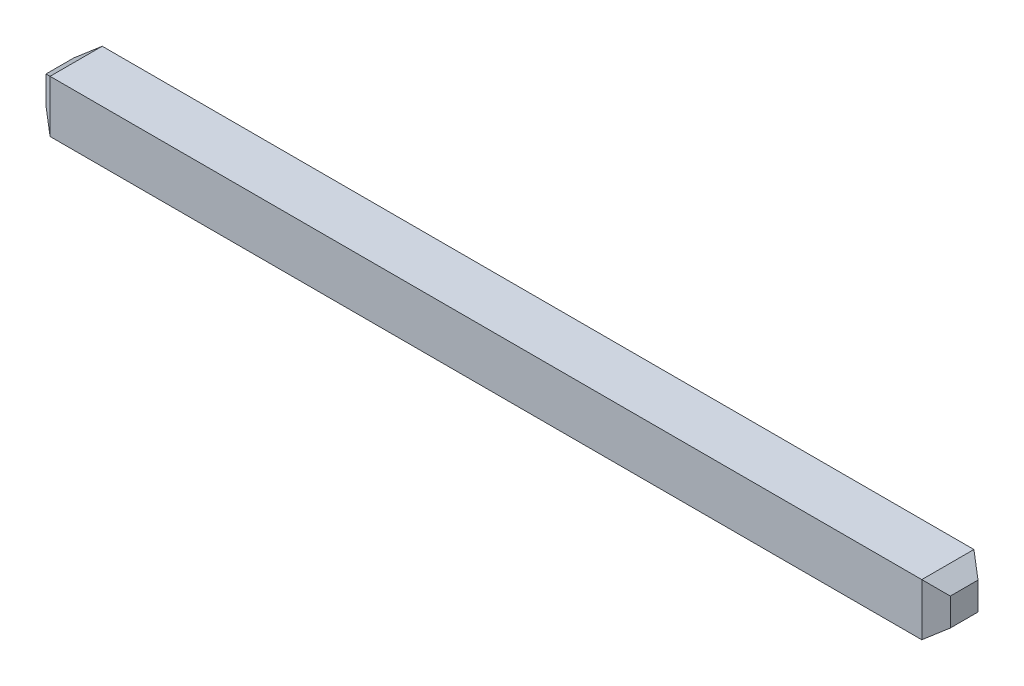
ISO-10303-21;
HEADER;
FILE_DESCRIPTION(('STEP AP214'),'2;1');
FILE_NAME('part.step','',(''),(''),'','','');
FILE_SCHEMA(('AUTOMOTIVE_DESIGN { 1 0 10303 214 1 1 1 1 }'));
ENDSEC;
DATA;
#1=APPLICATION_CONTEXT('core data for automotive mechanical design processes');
#2=APPLICATION_PROTOCOL_DEFINITION('international standard','automotive_design',2000,#1);
#3=PRODUCT_CONTEXT('',#1,'mechanical');
#4=PRODUCT('Part','Part','',(#3));
#5=PRODUCT_RELATED_PRODUCT_CATEGORY('part','',(#4));
#6=PRODUCT_DEFINITION_FORMATION('','',#4);
#7=PRODUCT_DEFINITION_CONTEXT('part definition',#1,'design');
#8=PRODUCT_DEFINITION('design','',#6,#7);
#9=PRODUCT_DEFINITION_SHAPE('','',#8);
#10=(LENGTH_UNIT() NAMED_UNIT(*) SI_UNIT(.MILLI.,.METRE.));
#11=(NAMED_UNIT(*) PLANE_ANGLE_UNIT() SI_UNIT($,.RADIAN.));
#12=(NAMED_UNIT(*) SI_UNIT($,.STERADIAN.) SOLID_ANGLE_UNIT());
#13=UNCERTAINTY_MEASURE_WITH_UNIT(LENGTH_MEASURE(1.E-05),#10,'distance_accuracy_value','');
#14=(GEOMETRIC_REPRESENTATION_CONTEXT(3) GLOBAL_UNCERTAINTY_ASSIGNED_CONTEXT((#13)) GLOBAL_UNIT_ASSIGNED_CONTEXT((#10,
#11,#12)) REPRESENTATION_CONTEXT('',''));
#15=CARTESIAN_POINT('',(0.,0.,0.));
#16=DIRECTION('',(0.,0.,1.));
#17=DIRECTION('',(1.,0.,0.));
#18=AXIS2_PLACEMENT_3D('',#15,#16,#17);
#19=CARTESIAN_POINT('',(-2.4,1.23,-21.835));
#20=DIRECTION('',(0.5999999999908,0.,0.8000000000069));
#21=DIRECTION('',(0.8000000000069,0.,-0.5999999999908));
#22=AXIS2_PLACEMENT_3D('',#19,#20,#21);
#23=PLANE('',#22);
#24=DIRECTION('',(0.,1.,0.));
#25=VECTOR('',#24,1.);
#26=CARTESIAN_POINT('',(-2.3,1.23,-21.91));
#27=LINE('',#26,#25);
#28=CARTESIAN_POINT('',(-2.29999999999957,1.55,-21.9099999999994));
#29=VERTEX_POINT('',#28);
#30=CARTESIAN_POINT('',(-2.29999999999958,0.909999999999898,-21.9099999999994));
#31=VERTEX_POINT('',#30);
#32=EDGE_CURVE('E101',#29,#31,#27,.F.);
#33=ORIENTED_EDGE('',*,*,#32,.T.);
#34=DIRECTION('',(-0.685994340569495,0.514495755428344,0.514495755427429));
#35=VECTOR('',#34,1.);
#36=CARTESIAN_POINT('',(-2.30000000000009,0.909999999999786,-21.91));
#37=LINE('',#36,#35);
#38=CARTESIAN_POINT('',(-2.50000000000021,1.06000000000001,-21.7600000000003));
#39=VERTEX_POINT('',#38);
#40=EDGE_CURVE('E85',#31,#39,#37,.T.);
#41=ORIENTED_EDGE('',*,*,#40,.T.);
#42=DIRECTION('',(0.,1.,0.));
#43=VECTOR('',#42,1.);
#44=CARTESIAN_POINT('',(-2.5,1.23,-21.76));
#45=LINE('',#44,#43);
#46=CARTESIAN_POINT('',(-2.50000000000043,1.4,-21.7600000000006));
#47=VERTEX_POINT('',#46);
#48=EDGE_CURVE('E79',#39,#47,#45,.T.);
#49=ORIENTED_EDGE('',*,*,#48,.T.);
#50=DIRECTION('',(-0.685994340570038,-0.514495755427529,0.51449575542752));
#51=VECTOR('',#50,1.);
#52=CARTESIAN_POINT('',(-2.3,1.55,-21.91));
#53=LINE('',#52,#51);
#54=EDGE_CURVE('E20',#29,#47,#53,.T.);
#55=ORIENTED_EDGE('',*,*,#54,.F.);
#56=EDGE_LOOP('',(#33,#41,#49,#55));
#57=FACE_BOUND('',#56,.T.);
#58=ADVANCED_FACE('F17',(#57),#23,.F.);
#59=CARTESIAN_POINT('',(8.5,1.23,-21.835));
#60=DIRECTION('',(-0.5999999999908,0.,0.8000000000069));
#61=DIRECTION('',(0.8000000000069,0.,0.5999999999908));
#62=AXIS2_PLACEMENT_3D('',#59,#60,#61);
#63=PLANE('',#62);
#64=DIRECTION('',(0.,1.,0.));
#65=VECTOR('',#64,1.);
#66=CARTESIAN_POINT('',(8.6,1.23,-21.76));
#67=LINE('',#66,#65);
#68=CARTESIAN_POINT('',(8.6000000000002,1.06000000000003,-21.7600000000003));
#69=VERTEX_POINT('',#68);
#70=CARTESIAN_POINT('',(8.60000000000043,1.4,-21.7600000000006));
#71=VERTEX_POINT('',#70);
#72=EDGE_CURVE('E113',#69,#71,#67,.T.);
#73=ORIENTED_EDGE('',*,*,#72,.F.);
#74=DIRECTION('',(-0.685994340569496,-0.514495755428343,-0.514495755427429));
#75=VECTOR('',#74,1.);
#76=CARTESIAN_POINT('',(8.59999999999996,1.06000000000005,-21.76));
#77=LINE('',#76,#75);
#78=CARTESIAN_POINT('',(8.39999999999959,0.909999999999884,-21.9099999999994));
#79=VERTEX_POINT('',#78);
#80=EDGE_CURVE('E108',#69,#79,#77,.T.);
#81=ORIENTED_EDGE('',*,*,#80,.T.);
#82=DIRECTION('',(0.,1.,0.));
#83=VECTOR('',#82,1.);
#84=CARTESIAN_POINT('',(8.4,1.23,-21.91));
#85=LINE('',#84,#83);
#86=CARTESIAN_POINT('',(8.39999999999957,1.55,-21.9099999999994));
#87=VERTEX_POINT('',#86);
#88=EDGE_CURVE('E99',#79,#87,#85,.T.);
#89=ORIENTED_EDGE('',*,*,#88,.T.);
#90=DIRECTION('',(-0.685994340570037,0.514495755427528,-0.514495755427522));
#91=VECTOR('',#90,1.);
#92=CARTESIAN_POINT('',(8.6,1.4,-21.76));
#93=LINE('',#92,#91);
#94=EDGE_CURVE('E116',#71,#87,#93,.T.);
#95=ORIENTED_EDGE('',*,*,#94,.F.);
#96=EDGE_LOOP('',(#73,#81,#89,#95));
#97=FACE_BOUND('',#96,.T.);
#98=ADVANCED_FACE('F214',(#97),#63,.F.);
#99=CARTESIAN_POINT('',(-2.4,1.475,-21.59));
#100=DIRECTION('',(-0.6,0.8,0.));
#101=DIRECTION('',(-0.8,-0.6,0.));
#102=AXIS2_PLACEMENT_3D('',#99,#100,#101);
#103=PLANE('',#102);
#104=DIRECTION('',(-0.685994340575952,-0.514495755427526,-0.514495755419639));
#105=VECTOR('',#104,1.);
#106=CARTESIAN_POINT('',(-2.29999999999914,1.55,-21.2700000000012));
#107=LINE('',#106,#105);
#108=CARTESIAN_POINT('',(-2.29999999999989,1.55,-21.2700000000001));
#109=VERTEX_POINT('',#108);
#110=CARTESIAN_POINT('',(-2.50000000000022,1.4,-21.4199999999997));
#111=VERTEX_POINT('',#110);
#112=EDGE_CURVE('E128',#109,#111,#107,.T.);
#113=ORIENTED_EDGE('',*,*,#112,.F.);
#114=DIRECTION('',(0.,0.,1.));
#115=VECTOR('',#114,1.);
#116=CARTESIAN_POINT('',(-2.3,1.55,-21.59));
#117=LINE('',#116,#115);
#118=EDGE_CURVE('E93',#29,#109,#117,.T.);
#119=ORIENTED_EDGE('',*,*,#118,.F.);
#120=ORIENTED_EDGE('',*,*,#54,.T.);
#121=DIRECTION('',(0.,0.,-1.));
#122=VECTOR('',#121,1.);
#123=CARTESIAN_POINT('',(-2.5,1.4,-21.59));
#124=LINE('',#123,#122);
#125=EDGE_CURVE('E87',#47,#111,#124,.F.);
#126=ORIENTED_EDGE('',*,*,#125,.T.);
#127=EDGE_LOOP('',(#113,#119,#120,#126));
#128=FACE_BOUND('',#127,.T.);
#129=ADVANCED_FACE('F90',(#128),#103,.T.);
#130=CARTESIAN_POINT('',(-2.5,1.23,-21.59));
#131=DIRECTION('',(1.,0.,0.));
#132=DIRECTION('',(0.,0.,-1.));
#133=AXIS2_PLACEMENT_3D('',#130,#131,#132);
#134=PLANE('',#133);
#135=DIRECTION('',(0.,1.,0.));
#136=VECTOR('',#135,1.);
#137=CARTESIAN_POINT('',(-2.50000000000086,1.23,-21.4199999999989));
#138=LINE('',#137,#136);
#139=CARTESIAN_POINT('',(-2.50000000000021,1.06000000000001,-21.4199999999997));
#140=VERTEX_POINT('',#139);
#141=EDGE_CURVE('E97',#111,#140,#138,.F.);
#142=ORIENTED_EDGE('',*,*,#141,.F.);
#143=ORIENTED_EDGE('',*,*,#125,.F.);
#144=ORIENTED_EDGE('',*,*,#48,.F.);
#145=DIRECTION('',(0.,0.,1.));
#146=VECTOR('',#145,1.);
#147=CARTESIAN_POINT('',(-2.49999999999996,1.06000000000005,-21.59));
#148=LINE('',#147,#146);
#149=EDGE_CURVE('E105',#39,#140,#148,.T.);
#150=ORIENTED_EDGE('',*,*,#149,.T.);
#151=EDGE_LOOP('',(#142,#143,#144,#150));
#152=FACE_BOUND('',#151,.T.);
#153=ADVANCED_FACE('F95',(#152),#134,.F.);
#154=CARTESIAN_POINT('',(3.05,1.23,-21.91));
#155=DIRECTION('',(0.,0.,1.));
#156=DIRECTION('',(1.,0.,0.));
#157=AXIS2_PLACEMENT_3D('',#154,#155,#156);
#158=PLANE('',#157);
#159=ORIENTED_EDGE('',*,*,#32,.F.);
#160=DIRECTION('',(1.,0.,0.));
#161=VECTOR('',#160,1.);
#162=CARTESIAN_POINT('',(3.05,1.55,-21.91));
#163=LINE('',#162,#161);
#164=EDGE_CURVE('E122',#87,#29,#163,.F.);
#165=ORIENTED_EDGE('',*,*,#164,.F.);
#166=ORIENTED_EDGE('',*,*,#88,.F.);
#167=DIRECTION('',(1.,0.,0.));
#168=VECTOR('',#167,1.);
#169=CARTESIAN_POINT('',(3.05,0.91,-21.91));
#170=LINE('',#169,#168);
#171=EDGE_CURVE('E136',#79,#31,#170,.F.);
#172=ORIENTED_EDGE('',*,*,#171,.T.);
#173=EDGE_LOOP('',(#159,#165,#166,#172));
#174=FACE_BOUND('',#173,.T.);
#175=ADVANCED_FACE('F182',(#174),#158,.F.);
#176=CARTESIAN_POINT('',(-2.4,0.9849999999999,-21.59));
#177=DIRECTION('',(0.600000000000912,0.799999999999316,0.));
#178=DIRECTION('',(-0.799999999999316,0.600000000000912,0.));
#179=AXIS2_PLACEMENT_3D('',#176,#177,#178);
#180=PLANE('',#179);
#181=DIRECTION('',(0.,0.,1.));
#182=VECTOR('',#181,1.);
#183=CARTESIAN_POINT('',(-2.3,0.91,-21.59));
#184=LINE('',#183,#182);
#185=CARTESIAN_POINT('',(-2.29999999999983,0.909999999999856,-21.2700000000003));
#186=VERTEX_POINT('',#185);
#187=EDGE_CURVE('E139',#31,#186,#184,.T.);
#188=ORIENTED_EDGE('',*,*,#187,.T.);
#189=DIRECTION('',(0.685994340575831,-0.514495755427778,0.514495755419548));
#190=VECTOR('',#189,1.);
#191=CARTESIAN_POINT('',(-2.50000000000086,1.06,-21.4199999999989));
#192=LINE('',#191,#190);
#193=EDGE_CURVE('E131',#140,#186,#192,.T.);
#194=ORIENTED_EDGE('',*,*,#193,.F.);
#195=ORIENTED_EDGE('',*,*,#149,.F.);
#196=ORIENTED_EDGE('',*,*,#40,.F.);
#197=EDGE_LOOP('',(#188,#194,#195,#196));
#198=FACE_BOUND('',#197,.T.);
#199=ADVANCED_FACE('F179',(#198),#180,.F.);
#200=CARTESIAN_POINT('',(8.5,0.9849999999999,-21.59));
#201=DIRECTION('',(-0.600000000000912,0.799999999999316,0.));
#202=DIRECTION('',(-0.799999999999316,-0.600000000000912,0.));
#203=AXIS2_PLACEMENT_3D('',#200,#201,#202);
#204=PLANE('',#203);
#205=DIRECTION('',(0.,0.,-1.));
#206=VECTOR('',#205,1.);
#207=CARTESIAN_POINT('',(8.6,1.06,-21.59));
#208=LINE('',#207,#206);
#209=CARTESIAN_POINT('',(8.6000000000002,1.06000000000003,-21.4199999999997));
#210=VERTEX_POINT('',#209);
#211=EDGE_CURVE('E110',#210,#69,#208,.T.);
#212=ORIENTED_EDGE('',*,*,#211,.F.);
#213=DIRECTION('',(0.68599434057583,0.514495755427779,-0.514495755419548));
#214=VECTOR('',#213,1.);
#215=CARTESIAN_POINT('',(8.39999999999914,0.9099999999999,-21.2700000000012));
#216=LINE('',#215,#214);
#217=CARTESIAN_POINT('',(8.39999999999993,0.909999999999868,-21.2700000000001));
#218=VERTEX_POINT('',#217);
#219=EDGE_CURVE('E35',#218,#210,#216,.T.);
#220=ORIENTED_EDGE('',*,*,#219,.F.);
#221=DIRECTION('',(0.,0.,1.));
#222=VECTOR('',#221,1.);
#223=CARTESIAN_POINT('',(8.4,0.91,-21.59));
#224=LINE('',#223,#222);
#225=EDGE_CURVE('E134',#218,#79,#224,.F.);
#226=ORIENTED_EDGE('',*,*,#225,.T.);
#227=ORIENTED_EDGE('',*,*,#80,.F.);
#228=EDGE_LOOP('',(#212,#220,#226,#227));
#229=FACE_BOUND('',#228,.T.);
#230=ADVANCED_FACE('F181',(#229),#204,.F.);
#231=CARTESIAN_POINT('',(8.6,1.23,-21.59));
#232=DIRECTION('',(1.,0.,0.));
#233=DIRECTION('',(0.,0.,-1.));
#234=AXIS2_PLACEMENT_3D('',#231,#232,#233);
#235=PLANE('',#234);
#236=ORIENTED_EDGE('',*,*,#72,.T.);
#237=DIRECTION('',(0.,0.,1.));
#238=VECTOR('',#237,1.);
#239=CARTESIAN_POINT('',(8.6,1.4,-21.59));
#240=LINE('',#239,#238);
#241=CARTESIAN_POINT('',(8.60000000000021,1.4,-21.4199999999997));
#242=VERTEX_POINT('',#241);
#243=EDGE_CURVE('E119',#242,#71,#240,.F.);
#244=ORIENTED_EDGE('',*,*,#243,.F.);
#245=DIRECTION('',(0.,1.,0.));
#246=VECTOR('',#245,1.);
#247=CARTESIAN_POINT('',(8.60000000000086,1.23,-21.4199999999989));
#248=LINE('',#247,#246);
#249=EDGE_CURVE('E142',#210,#242,#248,.T.);
#250=ORIENTED_EDGE('',*,*,#249,.F.);
#251=ORIENTED_EDGE('',*,*,#211,.T.);
#252=EDGE_LOOP('',(#236,#244,#250,#251));
#253=FACE_BOUND('',#252,.T.);
#254=ADVANCED_FACE('F189',(#253),#235,.T.);
#255=CARTESIAN_POINT('',(8.5,1.475,-21.59));
#256=DIRECTION('',(0.6,0.8,0.));
#257=DIRECTION('',(-0.8,0.6,0.));
#258=AXIS2_PLACEMENT_3D('',#255,#256,#257);
#259=PLANE('',#258);
#260=DIRECTION('',(-0.685994340575951,0.514495755427527,0.514495755419639));
#261=VECTOR('',#260,1.);
#262=CARTESIAN_POINT('',(8.60000000000086,1.4,-21.4199999999989));
#263=LINE('',#262,#261);
#264=CARTESIAN_POINT('',(8.39999999999989,1.55,-21.2700000000001));
#265=VERTEX_POINT('',#264);
#266=EDGE_CURVE('E145',#242,#265,#263,.T.);
#267=ORIENTED_EDGE('',*,*,#266,.F.);
#268=ORIENTED_EDGE('',*,*,#243,.T.);
#269=ORIENTED_EDGE('',*,*,#94,.T.);
#270=DIRECTION('',(0.,0.,1.));
#271=VECTOR('',#270,1.);
#272=CARTESIAN_POINT('',(8.4,1.55,-21.59));
#273=LINE('',#272,#271);
#274=EDGE_CURVE('E125',#265,#87,#273,.F.);
#275=ORIENTED_EDGE('',*,*,#274,.F.);
#276=EDGE_LOOP('',(#267,#268,#269,#275));
#277=FACE_BOUND('',#276,.T.);
#278=ADVANCED_FACE('F170',(#277),#259,.T.);
#279=CARTESIAN_POINT('',(3.05,1.55,-21.59));
#280=DIRECTION('',(0.,1.,0.));
#281=DIRECTION('',(0.,0.,1.));
#282=AXIS2_PLACEMENT_3D('',#279,#280,#281);
#283=PLANE('',#282);
#284=DIRECTION('',(1.,0.,0.));
#285=VECTOR('',#284,1.);
#286=CARTESIAN_POINT('',(3.05,1.55,-21.27));
#287=LINE('',#286,#285);
#288=EDGE_CURVE('E148',#265,#109,#287,.F.);
#289=ORIENTED_EDGE('',*,*,#288,.F.);
#290=ORIENTED_EDGE('',*,*,#274,.T.);
#291=ORIENTED_EDGE('',*,*,#164,.T.);
#292=ORIENTED_EDGE('',*,*,#118,.T.);
#293=EDGE_LOOP('',(#289,#290,#291,#292));
#294=FACE_BOUND('',#293,.T.);
#295=ADVANCED_FACE('F173',(#294),#283,.T.);
#296=CARTESIAN_POINT('',(-2.4,1.23,-21.345));
#297=DIRECTION('',(-0.5999999999908,0.,0.8000000000069));
#298=DIRECTION('',(0.8000000000069,0.,0.5999999999908));
#299=AXIS2_PLACEMENT_3D('',#296,#297,#298);
#300=PLANE('',#299);
#301=ORIENTED_EDGE('',*,*,#193,.T.);
#302=DIRECTION('',(0.,1.,0.));
#303=VECTOR('',#302,1.);
#304=CARTESIAN_POINT('',(-2.3,1.23,-21.27));
#305=LINE('',#304,#303);
#306=EDGE_CURVE('E151',#109,#186,#305,.F.);
#307=ORIENTED_EDGE('',*,*,#306,.F.);
#308=ORIENTED_EDGE('',*,*,#112,.T.);
#309=ORIENTED_EDGE('',*,*,#141,.T.);
#310=EDGE_LOOP('',(#301,#307,#308,#309));
#311=FACE_BOUND('',#310,.T.);
#312=ADVANCED_FACE('F176',(#311),#300,.T.);
#313=CARTESIAN_POINT('',(3.05,0.91,-21.59));
#314=DIRECTION('',(0.,1.,0.));
#315=DIRECTION('',(0.,0.,1.));
#316=AXIS2_PLACEMENT_3D('',#313,#314,#315);
#317=PLANE('',#316);
#318=ORIENTED_EDGE('',*,*,#187,.F.);
#319=ORIENTED_EDGE('',*,*,#171,.F.);
#320=ORIENTED_EDGE('',*,*,#225,.F.);
#321=DIRECTION('',(1.,0.,0.));
#322=VECTOR('',#321,1.);
#323=CARTESIAN_POINT('',(3.05,0.9099999999999,-21.27));
#324=LINE('',#323,#322);
#325=EDGE_CURVE('E26',#186,#218,#324,.T.);
#326=ORIENTED_EDGE('',*,*,#325,.F.);
#327=EDGE_LOOP('',(#318,#319,#320,#326));
#328=FACE_BOUND('',#327,.T.);
#329=ADVANCED_FACE('F162',(#328),#317,.F.);
#330=CARTESIAN_POINT('',(8.5,1.23,-21.345));
#331=DIRECTION('',(0.5999999999908,0.,0.8000000000069));
#332=DIRECTION('',(0.8000000000069,0.,-0.5999999999908));
#333=AXIS2_PLACEMENT_3D('',#330,#331,#332);
#334=PLANE('',#333);
#335=ORIENTED_EDGE('',*,*,#266,.T.);
#336=DIRECTION('',(0.,1.,0.));
#337=VECTOR('',#336,1.);
#338=CARTESIAN_POINT('',(8.4,1.23,-21.27));
#339=LINE('',#338,#337);
#340=EDGE_CURVE('E11',#218,#265,#339,.T.);
#341=ORIENTED_EDGE('',*,*,#340,.F.);
#342=ORIENTED_EDGE('',*,*,#219,.T.);
#343=ORIENTED_EDGE('',*,*,#249,.T.);
#344=EDGE_LOOP('',(#335,#341,#342,#343));
#345=FACE_BOUND('',#344,.T.);
#346=ADVANCED_FACE('F166',(#345),#334,.T.);
#347=CARTESIAN_POINT('',(3.05,1.23,-21.27));
#348=DIRECTION('',(0.,0.,1.));
#349=DIRECTION('',(1.,0.,0.));
#350=AXIS2_PLACEMENT_3D('',#347,#348,#349);
#351=PLANE('',#350);
#352=ORIENTED_EDGE('',*,*,#325,.T.);
#353=ORIENTED_EDGE('',*,*,#340,.T.);
#354=ORIENTED_EDGE('',*,*,#288,.T.);
#355=ORIENTED_EDGE('',*,*,#306,.T.);
#356=EDGE_LOOP('',(#352,#353,#354,#355));
#357=FACE_BOUND('',#356,.T.);
#358=ADVANCED_FACE('F157',(#357),#351,.T.);
#359=CLOSED_SHELL('',(#58,#98,#129,#153,#175,#199,#230,#254,#278,#295,#312,#329,#346,#358));
#360=MANIFOLD_SOLID_BREP('B1',#359);
#361=ADVANCED_BREP_SHAPE_REPRESENTATION('',(#18,#360),#14);
#362=SHAPE_DEFINITION_REPRESENTATION(#9,#361);
ENDSEC;
END-ISO-10303-21;
